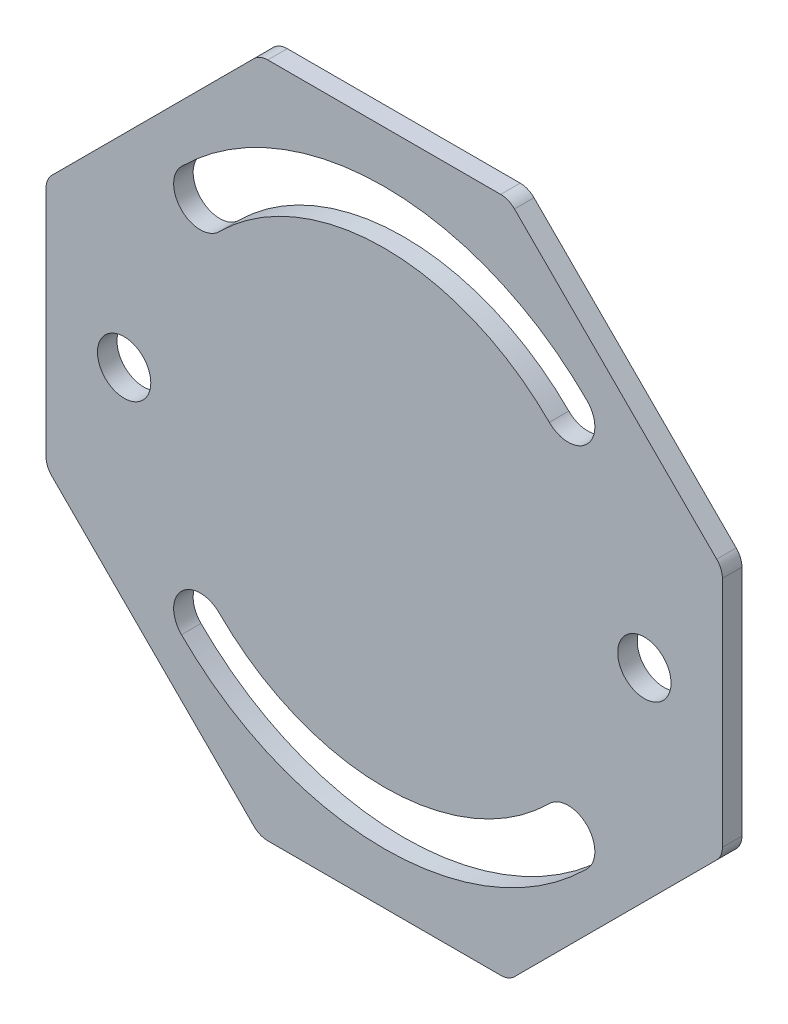
ISO-10303-21;
HEADER;
FILE_DESCRIPTION(('STEP AP214'),'2;1');
FILE_NAME('part.step','',(''),(''),'','','');
FILE_SCHEMA(('AUTOMOTIVE_DESIGN { 1 0 10303 214 1 1 1 1 }'));
ENDSEC;
DATA;
#1=APPLICATION_CONTEXT('core data for automotive mechanical design processes');
#2=APPLICATION_PROTOCOL_DEFINITION('international standard','automotive_design',2000,#1);
#3=PRODUCT_CONTEXT('',#1,'mechanical');
#4=PRODUCT('Part','Part','',(#3));
#5=PRODUCT_RELATED_PRODUCT_CATEGORY('part','',(#4));
#6=PRODUCT_DEFINITION_FORMATION('','',#4);
#7=PRODUCT_DEFINITION_CONTEXT('part definition',#1,'design');
#8=PRODUCT_DEFINITION('design','',#6,#7);
#9=PRODUCT_DEFINITION_SHAPE('','',#8);
#10=(LENGTH_UNIT() NAMED_UNIT(*) SI_UNIT(.MILLI.,.METRE.));
#11=(NAMED_UNIT(*) PLANE_ANGLE_UNIT() SI_UNIT($,.RADIAN.));
#12=(NAMED_UNIT(*) SI_UNIT($,.STERADIAN.) SOLID_ANGLE_UNIT());
#13=UNCERTAINTY_MEASURE_WITH_UNIT(LENGTH_MEASURE(1.E-05),#10,'distance_accuracy_value','');
#14=(GEOMETRIC_REPRESENTATION_CONTEXT(3) GLOBAL_UNCERTAINTY_ASSIGNED_CONTEXT((#13)) GLOBAL_UNIT_ASSIGNED_CONTEXT((#10,
#11,#12)) REPRESENTATION_CONTEXT('',''));
#15=CARTESIAN_POINT('',(0.,0.,0.));
#16=DIRECTION('',(0.,0.,1.));
#17=DIRECTION('',(1.,0.,0.));
#18=AXIS2_PLACEMENT_3D('',#15,#16,#17);
#19=CARTESIAN_POINT('',(0.,0.,3.));
#20=DIRECTION('',(0.,0.,-1.));
#21=DIRECTION('',(-1.,0.,0.));
#22=AXIS2_PLACEMENT_3D('',#19,#20,#21);
#23=PLANE('',#22);
#24=CARTESIAN_POINT('',(-28.284271247462,-28.2842712474618,3.));
#25=DIRECTION('',(0.,0.,1.));
#26=DIRECTION('',(1.,0.,0.));
#27=AXIS2_PLACEMENT_3D('',#24,#25,#26);
#28=CIRCLE('',#27,4.1);
#29=CARTESIAN_POINT('',(-25.3851334445972,-25.3851334445969,3.));
#30=VERTEX_POINT('',#29);
#31=CARTESIAN_POINT('',(-31.1834090503269,-31.1834090503266,3.));
#32=VERTEX_POINT('',#31);
#33=EDGE_CURVE('E219',#30,#32,#28,.T.);
#34=ORIENTED_EDGE('',*,*,#33,.F.);
#35=CARTESIAN_POINT('',(0.,0.,3.));
#36=DIRECTION('',(0.,0.,-1.));
#37=DIRECTION('',(1.,0.,0.));
#38=AXIS2_PLACEMENT_3D('',#35,#36,#37);
#39=CIRCLE('',#38,35.9);
#40=CARTESIAN_POINT('',(25.3851334445972,-25.3851334445969,3.));
#41=VERTEX_POINT('',#40);
#42=EDGE_CURVE('E227',#41,#30,#39,.T.);
#43=ORIENTED_EDGE('',*,*,#42,.F.);
#44=CARTESIAN_POINT('',(28.2842712474621,-28.2842712474618,3.));
#45=DIRECTION('',(0.,0.,1.));
#46=DIRECTION('',(1.,0.,0.));
#47=AXIS2_PLACEMENT_3D('',#44,#45,#46);
#48=CIRCLE('',#47,4.1);
#49=CARTESIAN_POINT('',(31.1834090503269,-31.1834090503266,3.));
#50=VERTEX_POINT('',#49);
#51=EDGE_CURVE('E224',#50,#41,#48,.T.);
#52=ORIENTED_EDGE('',*,*,#51,.F.);
#53=CARTESIAN_POINT('',(0.,0.,3.));
#54=DIRECTION('',(0.,0.,1.));
#55=DIRECTION('',(1.,0.,0.));
#56=AXIS2_PLACEMENT_3D('',#53,#54,#55);
#57=CIRCLE('',#56,44.1);
#58=EDGE_CURVE('E221',#32,#50,#57,.T.);
#59=ORIENTED_EDGE('',*,*,#58,.F.);
#60=EDGE_LOOP('',(#34,#43,#52,#59));
#61=FACE_BOUND('',#60,.T.);
#62=DIRECTION('',(-0.707106781186548,0.707106781186547,0.));
#63=VECTOR('',#62,1.);
#64=CARTESIAN_POINT('',(19.15,52.,3.));
#65=LINE('',#64,#63);
#66=CARTESIAN_POINT('',(51.1213203435596,20.0286796564404,3.));
#67=VERTEX_POINT('',#66);
#68=CARTESIAN_POINT('',(20.0286796564404,51.1213203435596,3.));
#69=VERTEX_POINT('',#68);
#70=EDGE_CURVE('E282',#67,#69,#65,.T.);
#71=ORIENTED_EDGE('',*,*,#70,.T.);
#72=CARTESIAN_POINT('',(17.9073593128807,49.,3.));
#73=DIRECTION('',(0.,0.,-1.));
#74=DIRECTION('',(-1.,0.,0.));
#75=AXIS2_PLACEMENT_3D('',#72,#73,#74);
#76=CIRCLE('',#75,3.);
#77=CARTESIAN_POINT('',(17.9073593128807,52.,3.));
#78=VERTEX_POINT('',#77);
#79=EDGE_CURVE('E345',#69,#78,#76,.F.);
#80=ORIENTED_EDGE('',*,*,#79,.T.);
#81=DIRECTION('',(-1.,0.,0.));
#82=VECTOR('',#81,1.);
#83=CARTESIAN_POINT('',(-19.15,52.,3.));
#84=LINE('',#83,#82);
#85=CARTESIAN_POINT('',(-17.9073593128807,52.,3.));
#86=VERTEX_POINT('',#85);
#87=EDGE_CURVE('E262',#78,#86,#84,.T.);
#88=ORIENTED_EDGE('',*,*,#87,.T.);
#89=CARTESIAN_POINT('',(-17.9073593128807,49.,3.));
#90=DIRECTION('',(0.,0.,-1.));
#91=DIRECTION('',(-1.,0.,0.));
#92=AXIS2_PLACEMENT_3D('',#89,#90,#91);
#93=CIRCLE('',#92,3.);
#94=CARTESIAN_POINT('',(-20.0286796564404,51.1213203435596,3.));
#95=VERTEX_POINT('',#94);
#96=EDGE_CURVE('E332',#86,#95,#93,.F.);
#97=ORIENTED_EDGE('',*,*,#96,.T.);
#98=DIRECTION('',(-0.707106781186547,-0.707106781186547,0.));
#99=VECTOR('',#98,1.);
#100=CARTESIAN_POINT('',(-52.,19.15,3.));
#101=LINE('',#100,#99);
#102=CARTESIAN_POINT('',(-51.1213203435596,20.0286796564404,3.));
#103=VERTEX_POINT('',#102);
#104=EDGE_CURVE('E265',#95,#103,#101,.T.);
#105=ORIENTED_EDGE('',*,*,#104,.T.);
#106=CARTESIAN_POINT('',(-49.,17.9073593128807,3.));
#107=DIRECTION('',(0.,0.,-1.));
#108=DIRECTION('',(-1.,0.,0.));
#109=AXIS2_PLACEMENT_3D('',#106,#107,#108);
#110=CIRCLE('',#109,3.);
#111=CARTESIAN_POINT('',(-52.,17.9073593128807,3.));
#112=VERTEX_POINT('',#111);
#113=EDGE_CURVE('E334',#103,#112,#110,.F.);
#114=ORIENTED_EDGE('',*,*,#113,.T.);
#115=DIRECTION('',(0.,-1.,0.));
#116=VECTOR('',#115,1.);
#117=CARTESIAN_POINT('',(-52.,19.15,3.));
#118=LINE('',#117,#116);
#119=CARTESIAN_POINT('',(-52.,-17.9073593128807,3.));
#120=VERTEX_POINT('',#119);
#121=EDGE_CURVE('E269',#112,#120,#118,.T.);
#122=ORIENTED_EDGE('',*,*,#121,.T.);
#123=CARTESIAN_POINT('',(-49.,-17.9073593128807,3.));
#124=DIRECTION('',(0.,0.,-1.));
#125=DIRECTION('',(-1.,0.,0.));
#126=AXIS2_PLACEMENT_3D('',#123,#124,#125);
#127=CIRCLE('',#126,3.);
#128=CARTESIAN_POINT('',(-51.1213203435596,-20.0286796564404,3.));
#129=VERTEX_POINT('',#128);
#130=EDGE_CURVE('E336',#120,#129,#127,.F.);
#131=ORIENTED_EDGE('',*,*,#130,.T.);
#132=DIRECTION('',(0.707106781186548,-0.707106781186548,0.));
#133=VECTOR('',#132,1.);
#134=CARTESIAN_POINT('',(-52.,-19.15,3.));
#135=LINE('',#134,#133);
#136=CARTESIAN_POINT('',(-20.0286796564403,-51.1213203435597,3.));
#137=VERTEX_POINT('',#136);
#138=EDGE_CURVE('E272',#129,#137,#135,.T.);
#139=ORIENTED_EDGE('',*,*,#138,.T.);
#140=CARTESIAN_POINT('',(-17.9073593128807,-49.,3.));
#141=DIRECTION('',(0.,0.,-1.));
#142=DIRECTION('',(-1.,0.,0.));
#143=AXIS2_PLACEMENT_3D('',#140,#141,#142);
#144=CIRCLE('',#143,3.);
#145=CARTESIAN_POINT('',(-17.9073593128807,-52.,3.));
#146=VERTEX_POINT('',#145);
#147=EDGE_CURVE('E338',#137,#146,#144,.F.);
#148=ORIENTED_EDGE('',*,*,#147,.T.);
#149=DIRECTION('',(1.,0.,0.));
#150=VECTOR('',#149,1.);
#151=CARTESIAN_POINT('',(-19.15,-52.,3.));
#152=LINE('',#151,#150);
#153=CARTESIAN_POINT('',(17.9073593128807,-52.,3.));
#154=VERTEX_POINT('',#153);
#155=EDGE_CURVE('E275',#146,#154,#152,.T.);
#156=ORIENTED_EDGE('',*,*,#155,.T.);
#157=CARTESIAN_POINT('',(17.9073593128807,-49.,3.));
#158=DIRECTION('',(0.,0.,-1.));
#159=DIRECTION('',(-1.,0.,0.));
#160=AXIS2_PLACEMENT_3D('',#157,#158,#159);
#161=CIRCLE('',#160,3.);
#162=CARTESIAN_POINT('',(20.0286796564404,-51.1213203435596,3.));
#163=VERTEX_POINT('',#162);
#164=EDGE_CURVE('E340',#154,#163,#161,.F.);
#165=ORIENTED_EDGE('',*,*,#164,.T.);
#166=DIRECTION('',(0.707106781186547,0.707106781186547,0.));
#167=VECTOR('',#166,1.);
#168=CARTESIAN_POINT('',(19.15,-52.,3.));
#169=LINE('',#168,#167);
#170=CARTESIAN_POINT('',(51.1213203435596,-20.0286796564404,3.));
#171=VERTEX_POINT('',#170);
#172=EDGE_CURVE('E278',#163,#171,#169,.T.);
#173=ORIENTED_EDGE('',*,*,#172,.T.);
#174=CARTESIAN_POINT('',(49.,-17.9073593128807,3.));
#175=DIRECTION('',(0.,0.,-1.));
#176=DIRECTION('',(-1.,0.,0.));
#177=AXIS2_PLACEMENT_3D('',#174,#175,#176);
#178=CIRCLE('',#177,3.);
#179=CARTESIAN_POINT('',(52.,-17.9073593128807,3.));
#180=VERTEX_POINT('',#179);
#181=EDGE_CURVE('E37',#171,#180,#178,.F.);
#182=ORIENTED_EDGE('',*,*,#181,.T.);
#183=DIRECTION('',(0.,1.,0.));
#184=VECTOR('',#183,1.);
#185=CARTESIAN_POINT('',(52.,19.15,3.));
#186=LINE('',#185,#184);
#187=CARTESIAN_POINT('',(52.,17.9073593128807,3.));
#188=VERTEX_POINT('',#187);
#189=EDGE_CURVE('E280',#180,#188,#186,.T.);
#190=ORIENTED_EDGE('',*,*,#189,.T.);
#191=CARTESIAN_POINT('',(49.,17.9073593128807,3.));
#192=DIRECTION('',(0.,0.,-1.));
#193=DIRECTION('',(-1.,0.,0.));
#194=AXIS2_PLACEMENT_3D('',#191,#192,#193);
#195=CIRCLE('',#194,3.);
#196=EDGE_CURVE('E343',#188,#67,#195,.F.);
#197=ORIENTED_EDGE('',*,*,#196,.T.);
#198=EDGE_LOOP('',(#71,#80,#88,#97,#105,#114,#122,#131,#139,#148,#156,#165,#173,#182,#190,#197));
#199=FACE_BOUND('',#198,.T.);
#200=CARTESIAN_POINT('',(-40.,0.,3.));
#201=DIRECTION('',(0.,0.,1.));
#202=DIRECTION('',(1.,0.,0.));
#203=AXIS2_PLACEMENT_3D('',#200,#201,#202);
#204=CIRCLE('',#203,4.1);
#205=CARTESIAN_POINT('',(-35.9,0.,3.));
#206=VERTEX_POINT('',#205);
#207=EDGE_CURVE('E256',#206,#206,#204,.T.);
#208=ORIENTED_EDGE('',*,*,#207,.F.);
#209=EDGE_LOOP('',(#208));
#210=FACE_BOUND('',#209,.T.);
#211=CARTESIAN_POINT('',(40.,0.,3.));
#212=DIRECTION('',(0.,0.,1.));
#213=DIRECTION('',(1.,0.,0.));
#214=AXIS2_PLACEMENT_3D('',#211,#212,#213);
#215=CIRCLE('',#214,4.1);
#216=CARTESIAN_POINT('',(44.1,0.,3.));
#217=VERTEX_POINT('',#216);
#218=EDGE_CURVE('E250',#217,#217,#215,.T.);
#219=ORIENTED_EDGE('',*,*,#218,.F.);
#220=EDGE_LOOP('',(#219));
#221=FACE_BOUND('',#220,.T.);
#222=CARTESIAN_POINT('',(-28.2842712474621,28.2842712474617,3.));
#223=DIRECTION('',(0.,0.,1.));
#224=DIRECTION('',(-1.,0.,0.));
#225=AXIS2_PLACEMENT_3D('',#222,#223,#224);
#226=CIRCLE('',#225,4.1);
#227=CARTESIAN_POINT('',(-31.1834090503269,31.1834090503266,3.));
#228=VERTEX_POINT('',#227);
#229=CARTESIAN_POINT('',(-25.3851334445972,25.3851334445969,3.));
#230=VERTEX_POINT('',#229);
#231=EDGE_CURVE('E178',#228,#230,#226,.T.);
#232=ORIENTED_EDGE('',*,*,#231,.F.);
#233=CARTESIAN_POINT('',(0.,0.,3.));
#234=DIRECTION('',(0.,0.,1.));
#235=DIRECTION('',(-1.,0.,0.));
#236=AXIS2_PLACEMENT_3D('',#233,#234,#235);
#237=CIRCLE('',#236,44.1);
#238=CARTESIAN_POINT('',(31.1834090503269,31.1834090503266,3.));
#239=VERTEX_POINT('',#238);
#240=EDGE_CURVE('E203',#239,#228,#237,.T.);
#241=ORIENTED_EDGE('',*,*,#240,.F.);
#242=CARTESIAN_POINT('',(28.2842712474621,28.2842712474618,3.));
#243=DIRECTION('',(0.,0.,1.));
#244=DIRECTION('',(-1.,0.,0.));
#245=AXIS2_PLACEMENT_3D('',#242,#243,#244);
#246=CIRCLE('',#245,4.1);
#247=CARTESIAN_POINT('',(25.3851334445972,25.3851334445969,3.));
#248=VERTEX_POINT('',#247);
#249=EDGE_CURVE('E201',#248,#239,#246,.T.);
#250=ORIENTED_EDGE('',*,*,#249,.F.);
#251=CARTESIAN_POINT('',(0.,0.,3.));
#252=DIRECTION('',(0.,0.,-1.));
#253=DIRECTION('',(-1.,0.,0.));
#254=AXIS2_PLACEMENT_3D('',#251,#252,#253);
#255=CIRCLE('',#254,35.9);
#256=EDGE_CURVE('E188',#230,#248,#255,.T.);
#257=ORIENTED_EDGE('',*,*,#256,.F.);
#258=EDGE_LOOP('',(#232,#241,#250,#257));
#259=FACE_BOUND('',#258,.T.);
#260=ADVANCED_FACE('F15',(#61,#199,#210,#221,#259),#23,.F.);
#261=CARTESIAN_POINT('',(0.,0.,0.));
#262=DIRECTION('',(0.,0.,-1.));
#263=DIRECTION('',(-1.,0.,0.));
#264=AXIS2_PLACEMENT_3D('',#261,#262,#263);
#265=PLANE('',#264);
#266=CARTESIAN_POINT('',(-40.,0.,0.));
#267=DIRECTION('',(0.,0.,1.));
#268=DIRECTION('',(1.,0.,0.));
#269=AXIS2_PLACEMENT_3D('',#266,#267,#268);
#270=CIRCLE('',#269,4.1);
#271=CARTESIAN_POINT('',(-35.9,0.,0.));
#272=VERTEX_POINT('',#271);
#273=EDGE_CURVE('E253',#272,#272,#270,.T.);
#274=ORIENTED_EDGE('',*,*,#273,.T.);
#275=EDGE_LOOP('',(#274));
#276=FACE_BOUND('',#275,.T.);
#277=DIRECTION('',(-1.,0.,0.));
#278=VECTOR('',#277,1.);
#279=CARTESIAN_POINT('',(-19.15,52.,0.));
#280=LINE('',#279,#278);
#281=CARTESIAN_POINT('',(17.9073593128807,52.,0.));
#282=VERTEX_POINT('',#281);
#283=CARTESIAN_POINT('',(-17.9073593128807,52.,0.));
#284=VERTEX_POINT('',#283);
#285=EDGE_CURVE('E259',#282,#284,#280,.T.);
#286=ORIENTED_EDGE('',*,*,#285,.F.);
#287=CARTESIAN_POINT('',(17.9073593128807,49.,0.));
#288=DIRECTION('',(0.,0.,-1.));
#289=DIRECTION('',(-1.,0.,0.));
#290=AXIS2_PLACEMENT_3D('',#287,#288,#289);
#291=CIRCLE('',#290,3.);
#292=CARTESIAN_POINT('',(20.0286796564404,51.1213203435596,0.));
#293=VERTEX_POINT('',#292);
#294=EDGE_CURVE('E325',#282,#293,#291,.T.);
#295=ORIENTED_EDGE('',*,*,#294,.T.);
#296=DIRECTION('',(-0.707106781186548,0.707106781186547,0.));
#297=VECTOR('',#296,1.);
#298=CARTESIAN_POINT('',(19.15,52.,0.));
#299=LINE('',#298,#297);
#300=CARTESIAN_POINT('',(51.1213203435596,20.0286796564404,0.));
#301=VERTEX_POINT('',#300);
#302=EDGE_CURVE('E266',#301,#293,#299,.T.);
#303=ORIENTED_EDGE('',*,*,#302,.F.);
#304=CARTESIAN_POINT('',(49.,17.9073593128807,0.));
#305=DIRECTION('',(0.,0.,-1.));
#306=DIRECTION('',(-1.,0.,0.));
#307=AXIS2_PLACEMENT_3D('',#304,#305,#306);
#308=CIRCLE('',#307,3.);
#309=CARTESIAN_POINT('',(52.,17.9073593128807,0.));
#310=VERTEX_POINT('',#309);
#311=EDGE_CURVE('E323',#301,#310,#308,.T.);
#312=ORIENTED_EDGE('',*,*,#311,.T.);
#313=DIRECTION('',(0.,1.,0.));
#314=VECTOR('',#313,1.);
#315=CARTESIAN_POINT('',(52.,19.15,0.));
#316=LINE('',#315,#314);
#317=CARTESIAN_POINT('',(52.,-17.9073593128807,0.));
#318=VERTEX_POINT('',#317);
#319=EDGE_CURVE('E303',#318,#310,#316,.T.);
#320=ORIENTED_EDGE('',*,*,#319,.F.);
#321=CARTESIAN_POINT('',(49.,-17.9073593128807,0.));
#322=DIRECTION('',(0.,0.,-1.));
#323=DIRECTION('',(-1.,0.,0.));
#324=AXIS2_PLACEMENT_3D('',#321,#322,#323);
#325=CIRCLE('',#324,3.);
#326=CARTESIAN_POINT('',(51.1213203435596,-20.0286796564404,0.));
#327=VERTEX_POINT('',#326);
#328=EDGE_CURVE('E321',#318,#327,#325,.T.);
#329=ORIENTED_EDGE('',*,*,#328,.T.);
#330=DIRECTION('',(0.707106781186547,0.707106781186547,0.));
#331=VECTOR('',#330,1.);
#332=CARTESIAN_POINT('',(19.15,-52.,0.));
#333=LINE('',#332,#331);
#334=CARTESIAN_POINT('',(20.0286796564404,-51.1213203435596,0.));
#335=VERTEX_POINT('',#334);
#336=EDGE_CURVE('E300',#335,#327,#333,.T.);
#337=ORIENTED_EDGE('',*,*,#336,.F.);
#338=CARTESIAN_POINT('',(17.9073593128807,-49.,0.));
#339=DIRECTION('',(0.,0.,-1.));
#340=DIRECTION('',(-1.,0.,0.));
#341=AXIS2_PLACEMENT_3D('',#338,#339,#340);
#342=CIRCLE('',#341,3.);
#343=CARTESIAN_POINT('',(17.9073593128807,-52.,0.));
#344=VERTEX_POINT('',#343);
#345=EDGE_CURVE('E319',#335,#344,#342,.T.);
#346=ORIENTED_EDGE('',*,*,#345,.T.);
#347=DIRECTION('',(1.,0.,0.));
#348=VECTOR('',#347,1.);
#349=CARTESIAN_POINT('',(-19.15,-52.,0.));
#350=LINE('',#349,#348);
#351=CARTESIAN_POINT('',(-17.9073593128807,-52.,0.));
#352=VERTEX_POINT('',#351);
#353=EDGE_CURVE('E297',#352,#344,#350,.T.);
#354=ORIENTED_EDGE('',*,*,#353,.F.);
#355=CARTESIAN_POINT('',(-17.9073593128807,-49.,0.));
#356=DIRECTION('',(0.,0.,-1.));
#357=DIRECTION('',(-1.,0.,0.));
#358=AXIS2_PLACEMENT_3D('',#355,#356,#357);
#359=CIRCLE('',#358,3.);
#360=CARTESIAN_POINT('',(-20.0286796564403,-51.1213203435597,0.));
#361=VERTEX_POINT('',#360);
#362=EDGE_CURVE('E317',#352,#361,#359,.T.);
#363=ORIENTED_EDGE('',*,*,#362,.T.);
#364=DIRECTION('',(0.707106781186548,-0.707106781186548,0.));
#365=VECTOR('',#364,1.);
#366=CARTESIAN_POINT('',(-52.,-19.15,0.));
#367=LINE('',#366,#365);
#368=CARTESIAN_POINT('',(-51.1213203435596,-20.0286796564404,0.));
#369=VERTEX_POINT('',#368);
#370=EDGE_CURVE('E294',#369,#361,#367,.T.);
#371=ORIENTED_EDGE('',*,*,#370,.F.);
#372=CARTESIAN_POINT('',(-49.,-17.9073593128807,0.));
#373=DIRECTION('',(0.,0.,-1.));
#374=DIRECTION('',(-1.,0.,0.));
#375=AXIS2_PLACEMENT_3D('',#372,#373,#374);
#376=CIRCLE('',#375,3.);
#377=CARTESIAN_POINT('',(-52.,-17.9073593128807,0.));
#378=VERTEX_POINT('',#377);
#379=EDGE_CURVE('E315',#369,#378,#376,.T.);
#380=ORIENTED_EDGE('',*,*,#379,.T.);
#381=DIRECTION('',(0.,-1.,0.));
#382=VECTOR('',#381,1.);
#383=CARTESIAN_POINT('',(-52.,19.15,0.));
#384=LINE('',#383,#382);
#385=CARTESIAN_POINT('',(-52.,17.9073593128807,0.));
#386=VERTEX_POINT('',#385);
#387=EDGE_CURVE('E291',#386,#378,#384,.T.);
#388=ORIENTED_EDGE('',*,*,#387,.F.);
#389=CARTESIAN_POINT('',(-49.,17.9073593128807,0.));
#390=DIRECTION('',(0.,0.,-1.));
#391=DIRECTION('',(-1.,0.,0.));
#392=AXIS2_PLACEMENT_3D('',#389,#390,#391);
#393=CIRCLE('',#392,3.);
#394=CARTESIAN_POINT('',(-51.1213203435596,20.0286796564404,0.));
#395=VERTEX_POINT('',#394);
#396=EDGE_CURVE('E313',#386,#395,#393,.T.);
#397=ORIENTED_EDGE('',*,*,#396,.T.);
#398=DIRECTION('',(-0.707106781186547,-0.707106781186547,0.));
#399=VECTOR('',#398,1.);
#400=CARTESIAN_POINT('',(-52.,19.15,0.));
#401=LINE('',#400,#399);
#402=CARTESIAN_POINT('',(-20.0286796564404,51.1213203435596,0.));
#403=VERTEX_POINT('',#402);
#404=EDGE_CURVE('E288',#403,#395,#401,.T.);
#405=ORIENTED_EDGE('',*,*,#404,.F.);
#406=CARTESIAN_POINT('',(-17.9073593128807,49.,0.));
#407=DIRECTION('',(0.,0.,-1.));
#408=DIRECTION('',(-1.,0.,0.));
#409=AXIS2_PLACEMENT_3D('',#406,#407,#408);
#410=CIRCLE('',#409,3.);
#411=EDGE_CURVE('E311',#403,#284,#410,.T.);
#412=ORIENTED_EDGE('',*,*,#411,.T.);
#413=EDGE_LOOP('',(#286,#295,#303,#312,#320,#329,#337,#346,#354,#363,#371,#380,#388,#397,#405,#412));
#414=FACE_BOUND('',#413,.T.);
#415=CARTESIAN_POINT('',(40.,0.,0.));
#416=DIRECTION('',(0.,0.,1.));
#417=DIRECTION('',(1.,0.,0.));
#418=AXIS2_PLACEMENT_3D('',#415,#416,#417);
#419=CIRCLE('',#418,4.1);
#420=CARTESIAN_POINT('',(44.1,0.,0.));
#421=VERTEX_POINT('',#420);
#422=EDGE_CURVE('E249',#421,#421,#419,.T.);
#423=ORIENTED_EDGE('',*,*,#422,.T.);
#424=EDGE_LOOP('',(#423));
#425=FACE_BOUND('',#424,.T.);
#426=CARTESIAN_POINT('',(0.,0.,0.));
#427=DIRECTION('',(0.,0.,-1.));
#428=DIRECTION('',(1.,0.,0.));
#429=AXIS2_PLACEMENT_3D('',#426,#427,#428);
#430=CIRCLE('',#429,35.9);
#431=CARTESIAN_POINT('',(25.3851334445972,-25.3851334445969,0.));
#432=VERTEX_POINT('',#431);
#433=CARTESIAN_POINT('',(-25.3851334445972,-25.3851334445969,0.));
#434=VERTEX_POINT('',#433);
#435=EDGE_CURVE('E222',#432,#434,#430,.T.);
#436=ORIENTED_EDGE('',*,*,#435,.T.);
#437=CARTESIAN_POINT('',(-28.284271247462,-28.2842712474618,0.));
#438=DIRECTION('',(0.,0.,1.));
#439=DIRECTION('',(1.,0.,0.));
#440=AXIS2_PLACEMENT_3D('',#437,#438,#439);
#441=CIRCLE('',#440,4.1);
#442=CARTESIAN_POINT('',(-31.1834090503269,-31.1834090503266,0.));
#443=VERTEX_POINT('',#442);
#444=EDGE_CURVE('E196',#434,#443,#441,.T.);
#445=ORIENTED_EDGE('',*,*,#444,.T.);
#446=CARTESIAN_POINT('',(0.,0.,0.));
#447=DIRECTION('',(0.,0.,1.));
#448=DIRECTION('',(1.,0.,0.));
#449=AXIS2_PLACEMENT_3D('',#446,#447,#448);
#450=CIRCLE('',#449,44.1);
#451=CARTESIAN_POINT('',(31.1834090503269,-31.1834090503266,0.));
#452=VERTEX_POINT('',#451);
#453=EDGE_CURVE('E232',#443,#452,#450,.T.);
#454=ORIENTED_EDGE('',*,*,#453,.T.);
#455=CARTESIAN_POINT('',(28.2842712474621,-28.2842712474618,0.));
#456=DIRECTION('',(0.,0.,1.));
#457=DIRECTION('',(1.,0.,0.));
#458=AXIS2_PLACEMENT_3D('',#455,#456,#457);
#459=CIRCLE('',#458,4.1);
#460=EDGE_CURVE('E235',#452,#432,#459,.T.);
#461=ORIENTED_EDGE('',*,*,#460,.T.);
#462=EDGE_LOOP('',(#436,#445,#454,#461));
#463=FACE_BOUND('',#462,.T.);
#464=CARTESIAN_POINT('',(0.,0.,0.));
#465=DIRECTION('',(0.,0.,1.));
#466=DIRECTION('',(-1.,0.,0.));
#467=AXIS2_PLACEMENT_3D('',#464,#465,#466);
#468=CIRCLE('',#467,44.1);
#469=CARTESIAN_POINT('',(31.1834090503269,31.1834090503266,0.));
#470=VERTEX_POINT('',#469);
#471=CARTESIAN_POINT('',(-31.1834090503269,31.1834090503266,0.));
#472=VERTEX_POINT('',#471);
#473=EDGE_CURVE('E189',#470,#472,#468,.T.);
#474=ORIENTED_EDGE('',*,*,#473,.T.);
#475=CARTESIAN_POINT('',(-28.2842712474621,28.2842712474617,0.));
#476=DIRECTION('',(0.,0.,1.));
#477=DIRECTION('',(-1.,0.,0.));
#478=AXIS2_PLACEMENT_3D('',#475,#476,#477);
#479=CIRCLE('',#478,4.1);
#480=CARTESIAN_POINT('',(-25.3851334445972,25.3851334445969,0.));
#481=VERTEX_POINT('',#480);
#482=EDGE_CURVE('E207',#472,#481,#479,.T.);
#483=ORIENTED_EDGE('',*,*,#482,.T.);
#484=CARTESIAN_POINT('',(0.,0.,0.));
#485=DIRECTION('',(0.,0.,-1.));
#486=DIRECTION('',(-1.,0.,0.));
#487=AXIS2_PLACEMENT_3D('',#484,#485,#486);
#488=CIRCLE('',#487,35.9);
#489=CARTESIAN_POINT('',(25.3851334445972,25.3851334445969,0.));
#490=VERTEX_POINT('',#489);
#491=EDGE_CURVE('E195',#481,#490,#488,.T.);
#492=ORIENTED_EDGE('',*,*,#491,.T.);
#493=CARTESIAN_POINT('',(28.2842712474621,28.2842712474618,0.));
#494=DIRECTION('',(0.,0.,1.));
#495=DIRECTION('',(-1.,0.,0.));
#496=AXIS2_PLACEMENT_3D('',#493,#494,#495);
#497=CIRCLE('',#496,4.1);
#498=EDGE_CURVE('E210',#490,#470,#497,.T.);
#499=ORIENTED_EDGE('',*,*,#498,.T.);
#500=EDGE_LOOP('',(#474,#483,#492,#499));
#501=FACE_BOUND('',#500,.T.);
#502=ADVANCED_FACE('F381',(#276,#414,#425,#463,#501),#265,.T.);
#503=CARTESIAN_POINT('',(-19.15,52.,3.));
#504=DIRECTION('',(0.,-1.,0.));
#505=DIRECTION('',(0.,0.,-1.));
#506=AXIS2_PLACEMENT_3D('',#503,#504,#505);
#507=PLANE('',#506);
#508=ORIENTED_EDGE('',*,*,#87,.F.);
#509=DIRECTION('',(0.,0.,-1.));
#510=VECTOR('',#509,1.);
#511=CARTESIAN_POINT('',(17.9073593128807,52.,3.));
#512=LINE('',#511,#510);
#513=EDGE_CURVE('E308',#78,#282,#512,.T.);
#514=ORIENTED_EDGE('',*,*,#513,.T.);
#515=ORIENTED_EDGE('',*,*,#285,.T.);
#516=DIRECTION('',(0.,0.,-1.));
#517=VECTOR('',#516,1.);
#518=CARTESIAN_POINT('',(-17.9073593128807,52.,3.));
#519=LINE('',#518,#517);
#520=EDGE_CURVE('E285',#284,#86,#519,.F.);
#521=ORIENTED_EDGE('',*,*,#520,.T.);
#522=EDGE_LOOP('',(#508,#514,#515,#521));
#523=FACE_BOUND('',#522,.T.);
#524=ADVANCED_FACE('F440',(#523),#507,.F.);
#525=CARTESIAN_POINT('',(-52.,19.15,3.));
#526=DIRECTION('',(0.707106781186548,-0.707106781186548,0.));
#527=DIRECTION('',(0.707106781186548,0.707106781186548,0.));
#528=AXIS2_PLACEMENT_3D('',#525,#526,#527);
#529=PLANE('',#528);
#530=ORIENTED_EDGE('',*,*,#404,.T.);
#531=DIRECTION('',(0.,0.,-1.));
#532=VECTOR('',#531,1.);
#533=CARTESIAN_POINT('',(-51.1213203435596,20.0286796564404,3.));
#534=LINE('',#533,#532);
#535=EDGE_CURVE('E9',#395,#103,#534,.F.);
#536=ORIENTED_EDGE('',*,*,#535,.T.);
#537=ORIENTED_EDGE('',*,*,#104,.F.);
#538=DIRECTION('',(0.,0.,-1.));
#539=VECTOR('',#538,1.);
#540=CARTESIAN_POINT('',(-20.0286796564404,51.1213203435596,3.));
#541=LINE('',#540,#539);
#542=EDGE_CURVE('E23',#95,#403,#541,.T.);
#543=ORIENTED_EDGE('',*,*,#542,.T.);
#544=EDGE_LOOP('',(#530,#536,#537,#543));
#545=FACE_BOUND('',#544,.T.);
#546=ADVANCED_FACE('F375',(#545),#529,.F.);
#547=CARTESIAN_POINT('',(-52.,19.15,3.));
#548=DIRECTION('',(1.,0.,0.));
#549=DIRECTION('',(0.,1.,0.));
#550=AXIS2_PLACEMENT_3D('',#547,#548,#549);
#551=PLANE('',#550);
#552=ORIENTED_EDGE('',*,*,#387,.T.);
#553=DIRECTION('',(0.,0.,-1.));
#554=VECTOR('',#553,1.);
#555=CARTESIAN_POINT('',(-52.,-17.9073593128807,3.));
#556=LINE('',#555,#554);
#557=EDGE_CURVE('E369',#378,#120,#556,.F.);
#558=ORIENTED_EDGE('',*,*,#557,.T.);
#559=ORIENTED_EDGE('',*,*,#121,.F.);
#560=DIRECTION('',(0.,0.,-1.));
#561=VECTOR('',#560,1.);
#562=CARTESIAN_POINT('',(-52.,17.9073593128807,3.));
#563=LINE('',#562,#561);
#564=EDGE_CURVE('E366',#112,#386,#563,.T.);
#565=ORIENTED_EDGE('',*,*,#564,.T.);
#566=EDGE_LOOP('',(#552,#558,#559,#565));
#567=FACE_BOUND('',#566,.T.);
#568=ADVANCED_FACE('F390',(#567),#551,.F.);
#569=CARTESIAN_POINT('',(-52.,-19.15,3.));
#570=DIRECTION('',(0.707106781186547,0.707106781186547,0.));
#571=DIRECTION('',(-0.707106781186548,0.707106781186548,0.));
#572=AXIS2_PLACEMENT_3D('',#569,#570,#571);
#573=PLANE('',#572);
#574=ORIENTED_EDGE('',*,*,#370,.T.);
#575=DIRECTION('',(0.,0.,-1.));
#576=VECTOR('',#575,1.);
#577=CARTESIAN_POINT('',(-20.0286796564404,-51.1213203435596,3.));
#578=LINE('',#577,#576);
#579=EDGE_CURVE('E364',#361,#137,#578,.F.);
#580=ORIENTED_EDGE('',*,*,#579,.T.);
#581=ORIENTED_EDGE('',*,*,#138,.F.);
#582=DIRECTION('',(0.,0.,-1.));
#583=VECTOR('',#582,1.);
#584=CARTESIAN_POINT('',(-51.1213203435596,-20.0286796564404,3.));
#585=LINE('',#584,#583);
#586=EDGE_CURVE('E361',#129,#369,#585,.T.);
#587=ORIENTED_EDGE('',*,*,#586,.T.);
#588=EDGE_LOOP('',(#574,#580,#581,#587));
#589=FACE_BOUND('',#588,.T.);
#590=ADVANCED_FACE('F400',(#589),#573,.F.);
#591=CARTESIAN_POINT('',(-19.15,-52.,3.));
#592=DIRECTION('',(0.,1.,0.));
#593=DIRECTION('',(0.,0.,1.));
#594=AXIS2_PLACEMENT_3D('',#591,#592,#593);
#595=PLANE('',#594);
#596=ORIENTED_EDGE('',*,*,#353,.T.);
#597=DIRECTION('',(0.,0.,-1.));
#598=VECTOR('',#597,1.);
#599=CARTESIAN_POINT('',(17.9073593128807,-52.,3.));
#600=LINE('',#599,#598);
#601=EDGE_CURVE('E359',#344,#154,#600,.F.);
#602=ORIENTED_EDGE('',*,*,#601,.T.);
#603=ORIENTED_EDGE('',*,*,#155,.F.);
#604=DIRECTION('',(0.,0.,-1.));
#605=VECTOR('',#604,1.);
#606=CARTESIAN_POINT('',(-17.9073593128807,-52.,3.));
#607=LINE('',#606,#605);
#608=EDGE_CURVE('E356',#146,#352,#607,.T.);
#609=ORIENTED_EDGE('',*,*,#608,.T.);
#610=EDGE_LOOP('',(#596,#602,#603,#609));
#611=FACE_BOUND('',#610,.T.);
#612=ADVANCED_FACE('F409',(#611),#595,.F.);
#613=CARTESIAN_POINT('',(19.15,-52.,3.));
#614=DIRECTION('',(-0.707106781186548,0.707106781186548,0.));
#615=DIRECTION('',(-0.707106781186548,-0.707106781186548,0.));
#616=AXIS2_PLACEMENT_3D('',#613,#614,#615);
#617=PLANE('',#616);
#618=ORIENTED_EDGE('',*,*,#336,.T.);
#619=DIRECTION('',(0.,0.,-1.));
#620=VECTOR('',#619,1.);
#621=CARTESIAN_POINT('',(51.1213203435596,-20.0286796564404,3.));
#622=LINE('',#621,#620);
#623=EDGE_CURVE('E354',#327,#171,#622,.F.);
#624=ORIENTED_EDGE('',*,*,#623,.T.);
#625=ORIENTED_EDGE('',*,*,#172,.F.);
#626=DIRECTION('',(0.,0.,-1.));
#627=VECTOR('',#626,1.);
#628=CARTESIAN_POINT('',(20.0286796564404,-51.1213203435596,3.));
#629=LINE('',#628,#627);
#630=EDGE_CURVE('E351',#163,#335,#629,.T.);
#631=ORIENTED_EDGE('',*,*,#630,.T.);
#632=EDGE_LOOP('',(#618,#624,#625,#631));
#633=FACE_BOUND('',#632,.T.);
#634=ADVANCED_FACE('F418',(#633),#617,.F.);
#635=CARTESIAN_POINT('',(52.,19.15,3.));
#636=DIRECTION('',(-1.,0.,0.));
#637=DIRECTION('',(0.,-1.,0.));
#638=AXIS2_PLACEMENT_3D('',#635,#636,#637);
#639=PLANE('',#638);
#640=ORIENTED_EDGE('',*,*,#319,.T.);
#641=DIRECTION('',(0.,0.,-1.));
#642=VECTOR('',#641,1.);
#643=CARTESIAN_POINT('',(52.,17.9073593128807,3.));
#644=LINE('',#643,#642);
#645=EDGE_CURVE('E30',#310,#188,#644,.F.);
#646=ORIENTED_EDGE('',*,*,#645,.T.);
#647=ORIENTED_EDGE('',*,*,#189,.F.);
#648=DIRECTION('',(0.,0.,-1.));
#649=VECTOR('',#648,1.);
#650=CARTESIAN_POINT('',(52.,-17.9073593128807,3.));
#651=LINE('',#650,#649);
#652=EDGE_CURVE('E347',#180,#318,#651,.T.);
#653=ORIENTED_EDGE('',*,*,#652,.T.);
#654=EDGE_LOOP('',(#640,#646,#647,#653));
#655=FACE_BOUND('',#654,.T.);
#656=ADVANCED_FACE('F424',(#655),#639,.F.);
#657=CARTESIAN_POINT('',(19.15,52.,3.));
#658=DIRECTION('',(-0.707106781186547,-0.707106781186548,0.));
#659=DIRECTION('',(0.707106781186548,-0.707106781186547,0.));
#660=AXIS2_PLACEMENT_3D('',#657,#658,#659);
#661=PLANE('',#660);
#662=ORIENTED_EDGE('',*,*,#302,.T.);
#663=DIRECTION('',(0.,0.,-1.));
#664=VECTOR('',#663,1.);
#665=CARTESIAN_POINT('',(20.0286796564404,51.1213203435596,3.));
#666=LINE('',#665,#664);
#667=EDGE_CURVE('E330',#293,#69,#666,.F.);
#668=ORIENTED_EDGE('',*,*,#667,.T.);
#669=ORIENTED_EDGE('',*,*,#70,.F.);
#670=DIRECTION('',(0.,0.,-1.));
#671=VECTOR('',#670,1.);
#672=CARTESIAN_POINT('',(51.1213203435596,20.0286796564404,3.));
#673=LINE('',#672,#671);
#674=EDGE_CURVE('E327',#67,#301,#673,.T.);
#675=ORIENTED_EDGE('',*,*,#674,.T.);
#676=EDGE_LOOP('',(#662,#668,#669,#675));
#677=FACE_BOUND('',#676,.T.);
#678=ADVANCED_FACE('F432',(#677),#661,.F.);
#679=CARTESIAN_POINT('',(-40.,0.,3.));
#680=DIRECTION('',(0.,0.,-1.));
#681=DIRECTION('',(-1.,0.,0.));
#682=AXIS2_PLACEMENT_3D('',#679,#680,#681);
#683=CYLINDRICAL_SURFACE('',#682,4.1);
#684=ORIENTED_EDGE('',*,*,#207,.T.);
#685=EDGE_LOOP('',(#684));
#686=FACE_BOUND('',#685,.T.);
#687=ORIENTED_EDGE('',*,*,#273,.F.);
#688=EDGE_LOOP('',(#687));
#689=FACE_BOUND('',#688,.T.);
#690=ADVANCED_FACE('F457',(#686,#689),#683,.F.);
#691=CARTESIAN_POINT('',(40.,0.,3.));
#692=DIRECTION('',(0.,0.,-1.));
#693=DIRECTION('',(-1.,0.,0.));
#694=AXIS2_PLACEMENT_3D('',#691,#692,#693);
#695=CYLINDRICAL_SURFACE('',#694,4.1);
#696=ORIENTED_EDGE('',*,*,#218,.T.);
#697=EDGE_LOOP('',(#696));
#698=FACE_BOUND('',#697,.T.);
#699=ORIENTED_EDGE('',*,*,#422,.F.);
#700=EDGE_LOOP('',(#699));
#701=FACE_BOUND('',#700,.T.);
#702=ADVANCED_FACE('F651',(#698,#701),#695,.F.);
#703=CARTESIAN_POINT('',(-28.284271247462,-28.2842712474618,3.));
#704=DIRECTION('',(0.,0.,-1.));
#705=DIRECTION('',(-1.,0.,0.));
#706=AXIS2_PLACEMENT_3D('',#703,#704,#705);
#707=CYLINDRICAL_SURFACE('',#706,4.1);
#708=ORIENTED_EDGE('',*,*,#444,.F.);
#709=DIRECTION('',(0.,0.,-1.));
#710=VECTOR('',#709,1.);
#711=CARTESIAN_POINT('',(-25.3851334445972,-25.3851334445969,3.));
#712=LINE('',#711,#710);
#713=EDGE_CURVE('E229',#30,#434,#712,.T.);
#714=ORIENTED_EDGE('',*,*,#713,.F.);
#715=ORIENTED_EDGE('',*,*,#33,.T.);
#716=DIRECTION('',(0.,0.,-1.));
#717=VECTOR('',#716,1.);
#718=CARTESIAN_POINT('',(-31.1834090503269,-31.1834090503266,3.));
#719=LINE('',#718,#717);
#720=EDGE_CURVE('E246',#32,#443,#719,.T.);
#721=ORIENTED_EDGE('',*,*,#720,.T.);
#722=EDGE_LOOP('',(#708,#714,#715,#721));
#723=FACE_BOUND('',#722,.T.);
#724=ADVANCED_FACE('F642',(#723),#707,.F.);
#725=CARTESIAN_POINT('',(0.,0.,3.));
#726=DIRECTION('',(0.,0.,-1.));
#727=DIRECTION('',(-1.,0.,0.));
#728=AXIS2_PLACEMENT_3D('',#725,#726,#727);
#729=CYLINDRICAL_SURFACE('',#728,44.1);
#730=ORIENTED_EDGE('',*,*,#453,.F.);
#731=ORIENTED_EDGE('',*,*,#720,.F.);
#732=ORIENTED_EDGE('',*,*,#58,.T.);
#733=DIRECTION('',(0.,0.,-1.));
#734=VECTOR('',#733,1.);
#735=CARTESIAN_POINT('',(31.1834090503269,-31.1834090503266,3.));
#736=LINE('',#735,#734);
#737=EDGE_CURVE('E244',#50,#452,#736,.T.);
#738=ORIENTED_EDGE('',*,*,#737,.T.);
#739=EDGE_LOOP('',(#730,#731,#732,#738));
#740=FACE_BOUND('',#739,.T.);
#741=ADVANCED_FACE('F633',(#740),#729,.F.);
#742=CARTESIAN_POINT('',(28.2842712474621,-28.2842712474618,3.));
#743=DIRECTION('',(0.,0.,-1.));
#744=DIRECTION('',(-1.,0.,0.));
#745=AXIS2_PLACEMENT_3D('',#742,#743,#744);
#746=CYLINDRICAL_SURFACE('',#745,4.1);
#747=ORIENTED_EDGE('',*,*,#460,.F.);
#748=ORIENTED_EDGE('',*,*,#737,.F.);
#749=ORIENTED_EDGE('',*,*,#51,.T.);
#750=DIRECTION('',(0.,0.,-1.));
#751=VECTOR('',#750,1.);
#752=CARTESIAN_POINT('',(25.3851334445972,-25.3851334445969,3.));
#753=LINE('',#752,#751);
#754=EDGE_CURVE('E242',#41,#432,#753,.T.);
#755=ORIENTED_EDGE('',*,*,#754,.T.);
#756=EDGE_LOOP('',(#747,#748,#749,#755));
#757=FACE_BOUND('',#756,.T.);
#758=ADVANCED_FACE('F624',(#757),#746,.F.);
#759=CARTESIAN_POINT('',(0.,0.,3.));
#760=DIRECTION('',(0.,0.,-1.));
#761=DIRECTION('',(-1.,0.,0.));
#762=AXIS2_PLACEMENT_3D('',#759,#760,#761);
#763=CYLINDRICAL_SURFACE('',#762,35.9);
#764=ORIENTED_EDGE('',*,*,#435,.F.);
#765=ORIENTED_EDGE('',*,*,#754,.F.);
#766=ORIENTED_EDGE('',*,*,#42,.T.);
#767=ORIENTED_EDGE('',*,*,#713,.T.);
#768=EDGE_LOOP('',(#764,#765,#766,#767));
#769=FACE_BOUND('',#768,.T.);
#770=ADVANCED_FACE('F616',(#769),#763,.T.);
#771=CARTESIAN_POINT('',(-28.2842712474621,28.2842712474617,3.));
#772=DIRECTION('',(0.,0.,-1.));
#773=DIRECTION('',(-1.,0.,0.));
#774=AXIS2_PLACEMENT_3D('',#771,#772,#773);
#775=CYLINDRICAL_SURFACE('',#774,4.1);
#776=ORIENTED_EDGE('',*,*,#482,.F.);
#777=DIRECTION('',(0.,0.,-1.));
#778=VECTOR('',#777,1.);
#779=CARTESIAN_POINT('',(-31.1834090503269,31.1834090503266,3.));
#780=LINE('',#779,#778);
#781=EDGE_CURVE('E184',#228,#472,#780,.T.);
#782=ORIENTED_EDGE('',*,*,#781,.F.);
#783=ORIENTED_EDGE('',*,*,#231,.T.);
#784=DIRECTION('',(0.,0.,-1.));
#785=VECTOR('',#784,1.);
#786=CARTESIAN_POINT('',(-25.3851334445972,25.3851334445969,3.));
#787=LINE('',#786,#785);
#788=EDGE_CURVE('E181',#230,#481,#787,.T.);
#789=ORIENTED_EDGE('',*,*,#788,.T.);
#790=EDGE_LOOP('',(#776,#782,#783,#789));
#791=FACE_BOUND('',#790,.T.);
#792=ADVANCED_FACE('F180',(#791),#775,.F.);
#793=CARTESIAN_POINT('',(0.,0.,3.));
#794=DIRECTION('',(0.,0.,-1.));
#795=DIRECTION('',(-1.,0.,0.));
#796=AXIS2_PLACEMENT_3D('',#793,#794,#795);
#797=CYLINDRICAL_SURFACE('',#796,35.9);
#798=ORIENTED_EDGE('',*,*,#491,.F.);
#799=ORIENTED_EDGE('',*,*,#788,.F.);
#800=ORIENTED_EDGE('',*,*,#256,.T.);
#801=DIRECTION('',(0.,0.,-1.));
#802=VECTOR('',#801,1.);
#803=CARTESIAN_POINT('',(25.3851334445972,25.3851334445969,3.));
#804=LINE('',#803,#802);
#805=EDGE_CURVE('E197',#248,#490,#804,.T.);
#806=ORIENTED_EDGE('',*,*,#805,.T.);
#807=EDGE_LOOP('',(#798,#799,#800,#806));
#808=FACE_BOUND('',#807,.T.);
#809=ADVANCED_FACE('F192',(#808),#797,.T.);
#810=CARTESIAN_POINT('',(28.2842712474621,28.2842712474618,3.));
#811=DIRECTION('',(0.,0.,-1.));
#812=DIRECTION('',(-1.,0.,0.));
#813=AXIS2_PLACEMENT_3D('',#810,#811,#812);
#814=CYLINDRICAL_SURFACE('',#813,4.1);
#815=ORIENTED_EDGE('',*,*,#498,.F.);
#816=ORIENTED_EDGE('',*,*,#805,.F.);
#817=ORIENTED_EDGE('',*,*,#249,.T.);
#818=DIRECTION('',(0.,0.,-1.));
#819=VECTOR('',#818,1.);
#820=CARTESIAN_POINT('',(31.1834090503269,31.1834090503266,3.));
#821=LINE('',#820,#819);
#822=EDGE_CURVE('E216',#239,#470,#821,.T.);
#823=ORIENTED_EDGE('',*,*,#822,.T.);
#824=EDGE_LOOP('',(#815,#816,#817,#823));
#825=FACE_BOUND('',#824,.T.);
#826=ADVANCED_FACE('F592',(#825),#814,.F.);
#827=CARTESIAN_POINT('',(0.,0.,3.));
#828=DIRECTION('',(0.,0.,-1.));
#829=DIRECTION('',(-1.,0.,0.));
#830=AXIS2_PLACEMENT_3D('',#827,#828,#829);
#831=CYLINDRICAL_SURFACE('',#830,44.1);
#832=ORIENTED_EDGE('',*,*,#473,.F.);
#833=ORIENTED_EDGE('',*,*,#822,.F.);
#834=ORIENTED_EDGE('',*,*,#240,.T.);
#835=ORIENTED_EDGE('',*,*,#781,.T.);
#836=EDGE_LOOP('',(#832,#833,#834,#835));
#837=FACE_BOUND('',#836,.T.);
#838=ADVANCED_FACE('F478',(#837),#831,.F.);
#839=CARTESIAN_POINT('',(17.9073593128807,49.,3.));
#840=DIRECTION('',(0.,0.,-1.));
#841=DIRECTION('',(-1.,0.,0.));
#842=AXIS2_PLACEMENT_3D('',#839,#840,#841);
#843=CYLINDRICAL_SURFACE('',#842,3.);
#844=ORIENTED_EDGE('',*,*,#79,.F.);
#845=ORIENTED_EDGE('',*,*,#667,.F.);
#846=ORIENTED_EDGE('',*,*,#294,.F.);
#847=ORIENTED_EDGE('',*,*,#513,.F.);
#848=EDGE_LOOP('',(#844,#845,#846,#847));
#849=FACE_BOUND('',#848,.T.);
#850=ADVANCED_FACE('F437',(#849),#843,.T.);
#851=CARTESIAN_POINT('',(49.,17.9073593128807,3.));
#852=DIRECTION('',(0.,0.,-1.));
#853=DIRECTION('',(-1.,0.,0.));
#854=AXIS2_PLACEMENT_3D('',#851,#852,#853);
#855=CYLINDRICAL_SURFACE('',#854,3.);
#856=ORIENTED_EDGE('',*,*,#196,.F.);
#857=ORIENTED_EDGE('',*,*,#645,.F.);
#858=ORIENTED_EDGE('',*,*,#311,.F.);
#859=ORIENTED_EDGE('',*,*,#674,.F.);
#860=EDGE_LOOP('',(#856,#857,#858,#859));
#861=FACE_BOUND('',#860,.T.);
#862=ADVANCED_FACE('F429',(#861),#855,.T.);
#863=CARTESIAN_POINT('',(49.,-17.9073593128807,3.));
#864=DIRECTION('',(0.,0.,-1.));
#865=DIRECTION('',(-1.,0.,0.));
#866=AXIS2_PLACEMENT_3D('',#863,#864,#865);
#867=CYLINDRICAL_SURFACE('',#866,3.);
#868=ORIENTED_EDGE('',*,*,#181,.F.);
#869=ORIENTED_EDGE('',*,*,#623,.F.);
#870=ORIENTED_EDGE('',*,*,#328,.F.);
#871=ORIENTED_EDGE('',*,*,#652,.F.);
#872=EDGE_LOOP('',(#868,#869,#870,#871));
#873=FACE_BOUND('',#872,.T.);
#874=ADVANCED_FACE('F423',(#873),#867,.T.);
#875=CARTESIAN_POINT('',(17.9073593128807,-49.,3.));
#876=DIRECTION('',(0.,0.,-1.));
#877=DIRECTION('',(-1.,0.,0.));
#878=AXIS2_PLACEMENT_3D('',#875,#876,#877);
#879=CYLINDRICAL_SURFACE('',#878,3.);
#880=ORIENTED_EDGE('',*,*,#164,.F.);
#881=ORIENTED_EDGE('',*,*,#601,.F.);
#882=ORIENTED_EDGE('',*,*,#345,.F.);
#883=ORIENTED_EDGE('',*,*,#630,.F.);
#884=EDGE_LOOP('',(#880,#881,#882,#883));
#885=FACE_BOUND('',#884,.T.);
#886=ADVANCED_FACE('F415',(#885),#879,.T.);
#887=CARTESIAN_POINT('',(-17.9073593128807,-49.,3.));
#888=DIRECTION('',(0.,0.,-1.));
#889=DIRECTION('',(-1.,0.,0.));
#890=AXIS2_PLACEMENT_3D('',#887,#888,#889);
#891=CYLINDRICAL_SURFACE('',#890,3.);
#892=ORIENTED_EDGE('',*,*,#147,.F.);
#893=ORIENTED_EDGE('',*,*,#579,.F.);
#894=ORIENTED_EDGE('',*,*,#362,.F.);
#895=ORIENTED_EDGE('',*,*,#608,.F.);
#896=EDGE_LOOP('',(#892,#893,#894,#895));
#897=FACE_BOUND('',#896,.T.);
#898=ADVANCED_FACE('F406',(#897),#891,.T.);
#899=CARTESIAN_POINT('',(-49.,-17.9073593128807,3.));
#900=DIRECTION('',(0.,0.,-1.));
#901=DIRECTION('',(-1.,0.,0.));
#902=AXIS2_PLACEMENT_3D('',#899,#900,#901);
#903=CYLINDRICAL_SURFACE('',#902,3.);
#904=ORIENTED_EDGE('',*,*,#130,.F.);
#905=ORIENTED_EDGE('',*,*,#557,.F.);
#906=ORIENTED_EDGE('',*,*,#379,.F.);
#907=ORIENTED_EDGE('',*,*,#586,.F.);
#908=EDGE_LOOP('',(#904,#905,#906,#907));
#909=FACE_BOUND('',#908,.T.);
#910=ADVANCED_FACE('F397',(#909),#903,.T.);
#911=CARTESIAN_POINT('',(-49.,17.9073593128807,3.));
#912=DIRECTION('',(0.,0.,-1.));
#913=DIRECTION('',(-1.,0.,0.));
#914=AXIS2_PLACEMENT_3D('',#911,#912,#913);
#915=CYLINDRICAL_SURFACE('',#914,3.);
#916=ORIENTED_EDGE('',*,*,#113,.F.);
#917=ORIENTED_EDGE('',*,*,#535,.F.);
#918=ORIENTED_EDGE('',*,*,#396,.F.);
#919=ORIENTED_EDGE('',*,*,#564,.F.);
#920=EDGE_LOOP('',(#916,#917,#918,#919));
#921=FACE_BOUND('',#920,.T.);
#922=ADVANCED_FACE('F387',(#921),#915,.T.);
#923=CARTESIAN_POINT('',(-17.9073593128807,49.,3.));
#924=DIRECTION('',(0.,0.,-1.));
#925=DIRECTION('',(-1.,0.,0.));
#926=AXIS2_PLACEMENT_3D('',#923,#924,#925);
#927=CYLINDRICAL_SURFACE('',#926,3.);
#928=ORIENTED_EDGE('',*,*,#96,.F.);
#929=ORIENTED_EDGE('',*,*,#520,.F.);
#930=ORIENTED_EDGE('',*,*,#411,.F.);
#931=ORIENTED_EDGE('',*,*,#542,.F.);
#932=EDGE_LOOP('',(#928,#929,#930,#931));
#933=FACE_BOUND('',#932,.T.);
#934=ADVANCED_FACE('F17',(#933),#927,.T.);
#935=CLOSED_SHELL('',(#260,#502,#524,#546,#568,#590,#612,#634,#656,#678,#690,#702,#724,#741,
#758,#770,#792,#809,#826,#838,#850,#862,#874,#886,#898,#910,#922,#934));
#936=MANIFOLD_SOLID_BREP('B1',#935);
#937=ADVANCED_BREP_SHAPE_REPRESENTATION('',(#18,#936),#14);
#938=SHAPE_DEFINITION_REPRESENTATION(#9,#937);
ENDSEC;
END-ISO-10303-21;
